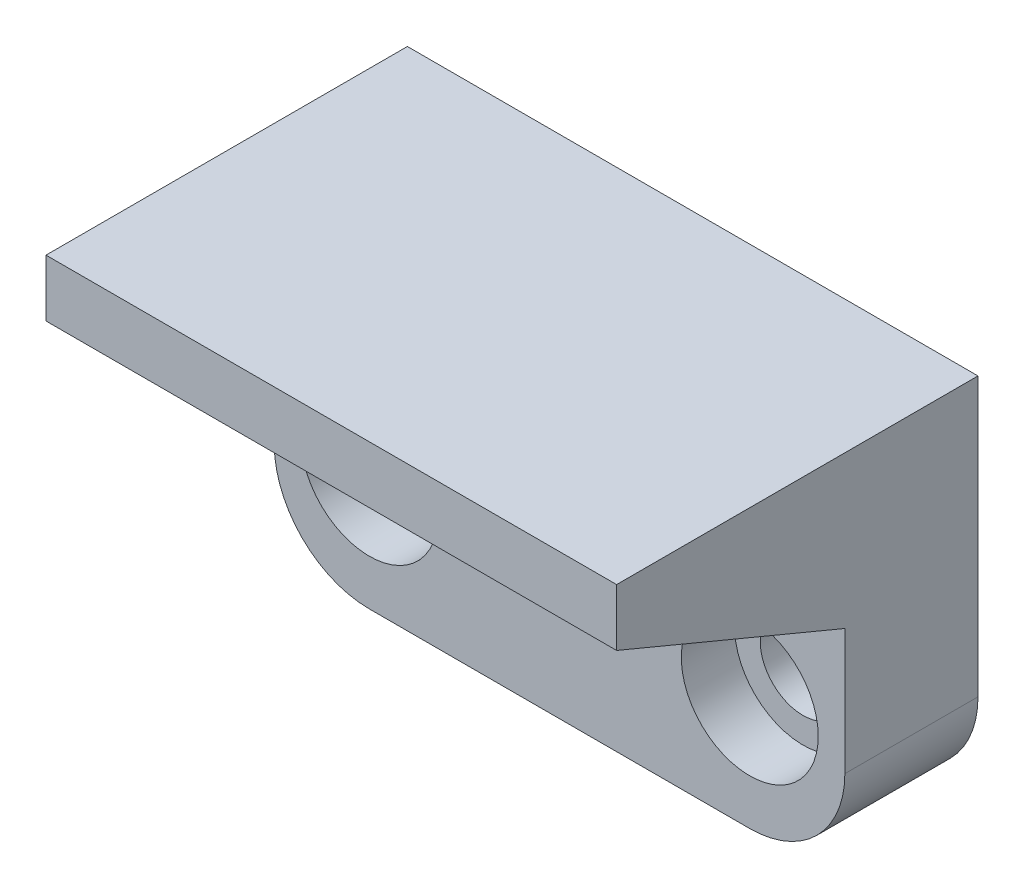
ISO-10303-21;
HEADER;
FILE_DESCRIPTION(('STEP AP214'),'2;1');
FILE_NAME('part.step','',(''),(''),'','','');
FILE_SCHEMA(('AUTOMOTIVE_DESIGN { 1 0 10303 214 1 1 1 1 }'));
ENDSEC;
DATA;
#1=APPLICATION_CONTEXT('core data for automotive mechanical design processes');
#2=APPLICATION_PROTOCOL_DEFINITION('international standard','automotive_design',2000,#1);
#3=PRODUCT_CONTEXT('',#1,'mechanical');
#4=PRODUCT('Part','Part','',(#3));
#5=PRODUCT_RELATED_PRODUCT_CATEGORY('part','',(#4));
#6=PRODUCT_DEFINITION_FORMATION('','',#4);
#7=PRODUCT_DEFINITION_CONTEXT('part definition',#1,'design');
#8=PRODUCT_DEFINITION('design','',#6,#7);
#9=PRODUCT_DEFINITION_SHAPE('','',#8);
#10=(LENGTH_UNIT() NAMED_UNIT(*) SI_UNIT(.MILLI.,.METRE.));
#11=(NAMED_UNIT(*) PLANE_ANGLE_UNIT() SI_UNIT($,.RADIAN.));
#12=(NAMED_UNIT(*) SI_UNIT($,.STERADIAN.) SOLID_ANGLE_UNIT());
#13=UNCERTAINTY_MEASURE_WITH_UNIT(LENGTH_MEASURE(1.E-05),#10,'distance_accuracy_value','');
#14=(GEOMETRIC_REPRESENTATION_CONTEXT(3) GLOBAL_UNCERTAINTY_ASSIGNED_CONTEXT((#13)) GLOBAL_UNIT_ASSIGNED_CONTEXT((#10,
#11,#12)) REPRESENTATION_CONTEXT('',''));
#15=CARTESIAN_POINT('',(0.,0.,0.));
#16=DIRECTION('',(0.,0.,1.));
#17=DIRECTION('',(1.,0.,0.));
#18=AXIS2_PLACEMENT_3D('',#15,#16,#17);
#19=CARTESIAN_POINT('',(0.,0.,7.));
#20=DIRECTION('',(0.,0.,1.));
#21=DIRECTION('',(1.,0.,0.));
#22=AXIS2_PLACEMENT_3D('',#19,#20,#21);
#23=PLANE('',#22);
#24=CARTESIAN_POINT('',(-10.,-3.805,7.));
#25=DIRECTION('',(0.,0.,1.));
#26=DIRECTION('',(1.,0.,0.));
#27=AXIS2_PLACEMENT_3D('',#24,#25,#26);
#28=CIRCLE('',#27,3.6);
#29=CARTESIAN_POINT('',(-6.40000000000001,-3.805,7.));
#30=VERTEX_POINT('',#29);
#31=EDGE_CURVE('E154',#30,#30,#28,.T.);
#32=ORIENTED_EDGE('',*,*,#31,.F.);
#33=EDGE_LOOP('',(#32));
#34=FACE_BOUND('',#33,.T.);
#35=CARTESIAN_POINT('',(9.99999999999999,-3.805,7.));
#36=DIRECTION('',(0.,0.,1.));
#37=DIRECTION('',(1.,0.,0.));
#38=AXIS2_PLACEMENT_3D('',#35,#36,#37);
#39=CIRCLE('',#38,3.6);
#40=CARTESIAN_POINT('',(13.6,-3.805,7.));
#41=VERTEX_POINT('',#40);
#42=EDGE_CURVE('E146',#41,#41,#39,.T.);
#43=ORIENTED_EDGE('',*,*,#42,.F.);
#44=EDGE_LOOP('',(#43));
#45=FACE_BOUND('',#44,.T.);
#46=DIRECTION('',(0.,1.,0.));
#47=VECTOR('',#46,1.);
#48=CARTESIAN_POINT('',(15.,9.805,7.));
#49=LINE('',#48,#47);
#50=CARTESIAN_POINT('',(15.,-4.805,7.));
#51=VERTEX_POINT('',#50);
#52=CARTESIAN_POINT('',(15.,1.80500000000001,7.));
#53=VERTEX_POINT('',#52);
#54=EDGE_CURVE('E174',#51,#53,#49,.T.);
#55=ORIENTED_EDGE('',*,*,#54,.T.);
#56=DIRECTION('',(-1.,0.,0.));
#57=VECTOR('',#56,1.);
#58=CARTESIAN_POINT('',(15.,1.80500000000001,7.));
#59=LINE('',#58,#57);
#60=CARTESIAN_POINT('',(-15.,1.80500000000001,7.));
#61=VERTEX_POINT('',#60);
#62=EDGE_CURVE('E129',#53,#61,#59,.T.);
#63=ORIENTED_EDGE('',*,*,#62,.T.);
#64=DIRECTION('',(0.,-1.,0.));
#65=VECTOR('',#64,1.);
#66=CARTESIAN_POINT('',(-15.,9.805,7.));
#67=LINE('',#66,#65);
#68=CARTESIAN_POINT('',(-15.,-4.805,7.));
#69=VERTEX_POINT('',#68);
#70=EDGE_CURVE('E62',#61,#69,#67,.T.);
#71=ORIENTED_EDGE('',*,*,#70,.T.);
#72=CARTESIAN_POINT('',(-10.,-4.805,7.));
#73=DIRECTION('',(0.,0.,1.));
#74=DIRECTION('',(1.,0.,0.));
#75=AXIS2_PLACEMENT_3D('',#72,#73,#74);
#76=CIRCLE('',#75,5.);
#77=CARTESIAN_POINT('',(-10.,-9.805,7.));
#78=VERTEX_POINT('',#77);
#79=EDGE_CURVE('E220',#69,#78,#76,.T.);
#80=ORIENTED_EDGE('',*,*,#79,.T.);
#81=DIRECTION('',(1.,0.,0.));
#82=VECTOR('',#81,1.);
#83=CARTESIAN_POINT('',(-15.,-9.805,7.));
#84=LINE('',#83,#82);
#85=CARTESIAN_POINT('',(9.99999999999999,-9.805,7.));
#86=VERTEX_POINT('',#85);
#87=EDGE_CURVE('E181',#78,#86,#84,.T.);
#88=ORIENTED_EDGE('',*,*,#87,.T.);
#89=CARTESIAN_POINT('',(9.99999999999999,-4.805,7.));
#90=DIRECTION('',(0.,0.,1.));
#91=DIRECTION('',(1.,0.,0.));
#92=AXIS2_PLACEMENT_3D('',#89,#90,#91);
#93=CIRCLE('',#92,5.);
#94=EDGE_CURVE('E48',#86,#51,#93,.T.);
#95=ORIENTED_EDGE('',*,*,#94,.T.);
#96=EDGE_LOOP('',(#55,#63,#71,#80,#88,#95));
#97=FACE_BOUND('',#96,.T.);
#98=ADVANCED_FACE('F39',(#34,#45,#97),#23,.T.);
#99=CARTESIAN_POINT('',(-10.,-3.805,7.));
#100=DIRECTION('',(0.,0.,-1.));
#101=DIRECTION('',(-1.,0.,0.));
#102=AXIS2_PLACEMENT_3D('',#99,#100,#101);
#103=CYLINDRICAL_SURFACE('',#102,2.25);
#104=CARTESIAN_POINT('',(-10.,-3.805,0.));
#105=DIRECTION('',(0.,0.,1.));
#106=DIRECTION('',(1.,0.,0.));
#107=AXIS2_PLACEMENT_3D('',#104,#105,#106);
#108=CIRCLE('',#107,2.25);
#109=CARTESIAN_POINT('',(-7.75000000000001,-3.805,0.));
#110=VERTEX_POINT('',#109);
#111=EDGE_CURVE('E169',#110,#110,#108,.T.);
#112=ORIENTED_EDGE('',*,*,#111,.F.);
#113=EDGE_LOOP('',(#112));
#114=FACE_BOUND('',#113,.T.);
#115=CARTESIAN_POINT('',(-10.,-3.805,4.2));
#116=DIRECTION('',(0.,0.,1.));
#117=DIRECTION('',(1.,0.,0.));
#118=AXIS2_PLACEMENT_3D('',#115,#116,#117);
#119=CIRCLE('',#118,2.25);
#120=CARTESIAN_POINT('',(-7.75000000000001,-3.805,4.2));
#121=VERTEX_POINT('',#120);
#122=EDGE_CURVE('E170',#121,#121,#119,.T.);
#123=ORIENTED_EDGE('',*,*,#122,.T.);
#124=EDGE_LOOP('',(#123));
#125=FACE_BOUND('',#124,.T.);
#126=ADVANCED_FACE('F253',(#114,#125),#103,.F.);
#127=CARTESIAN_POINT('',(9.99999999999999,-3.805,7.));
#128=DIRECTION('',(0.,0.,-1.));
#129=DIRECTION('',(-1.,0.,0.));
#130=AXIS2_PLACEMENT_3D('',#127,#128,#129);
#131=CYLINDRICAL_SURFACE('',#130,2.25);
#132=CARTESIAN_POINT('',(9.99999999999999,-3.805,0.));
#133=DIRECTION('',(0.,0.,1.));
#134=DIRECTION('',(1.,0.,0.));
#135=AXIS2_PLACEMENT_3D('',#132,#133,#134);
#136=CIRCLE('',#135,2.25);
#137=CARTESIAN_POINT('',(12.25,-3.805,0.));
#138=VERTEX_POINT('',#137);
#139=EDGE_CURVE('E165',#138,#138,#136,.T.);
#140=ORIENTED_EDGE('',*,*,#139,.F.);
#141=EDGE_LOOP('',(#140));
#142=FACE_BOUND('',#141,.T.);
#143=CARTESIAN_POINT('',(9.99999999999999,-3.805,4.2));
#144=DIRECTION('',(0.,0.,1.));
#145=DIRECTION('',(1.,0.,0.));
#146=AXIS2_PLACEMENT_3D('',#143,#144,#145);
#147=CIRCLE('',#146,2.25);
#148=CARTESIAN_POINT('',(12.25,-3.805,4.2));
#149=VERTEX_POINT('',#148);
#150=EDGE_CURVE('E153',#149,#149,#147,.T.);
#151=ORIENTED_EDGE('',*,*,#150,.T.);
#152=EDGE_LOOP('',(#151));
#153=FACE_BOUND('',#152,.T.);
#154=ADVANCED_FACE('F261',(#142,#153),#131,.F.);
#155=CARTESIAN_POINT('',(0.,0.,0.));
#156=DIRECTION('',(0.,0.,1.));
#157=DIRECTION('',(1.,0.,0.));
#158=AXIS2_PLACEMENT_3D('',#155,#156,#157);
#159=PLANE('',#158);
#160=DIRECTION('',(0.,1.,0.));
#161=VECTOR('',#160,1.);
#162=CARTESIAN_POINT('',(15.,9.805,0.));
#163=LINE('',#162,#161);
#164=CARTESIAN_POINT('',(15.,-4.805,0.));
#165=VERTEX_POINT('',#164);
#166=CARTESIAN_POINT('',(15.,9.805,0.));
#167=VERTEX_POINT('',#166);
#168=EDGE_CURVE('E114',#165,#167,#163,.T.);
#169=ORIENTED_EDGE('',*,*,#168,.F.);
#170=CARTESIAN_POINT('',(9.99999999999999,-4.805,0.));
#171=DIRECTION('',(0.,0.,1.));
#172=DIRECTION('',(1.,0.,0.));
#173=AXIS2_PLACEMENT_3D('',#170,#171,#172);
#174=CIRCLE('',#173,5.);
#175=CARTESIAN_POINT('',(9.99999999999999,-9.805,0.));
#176=VERTEX_POINT('',#175);
#177=EDGE_CURVE('E210',#165,#176,#174,.F.);
#178=ORIENTED_EDGE('',*,*,#177,.T.);
#179=DIRECTION('',(1.,0.,0.));
#180=VECTOR('',#179,1.);
#181=CARTESIAN_POINT('',(-15.,-9.805,0.));
#182=LINE('',#181,#180);
#183=CARTESIAN_POINT('',(-10.,-9.805,0.));
#184=VERTEX_POINT('',#183);
#185=EDGE_CURVE('E178',#184,#176,#182,.T.);
#186=ORIENTED_EDGE('',*,*,#185,.F.);
#187=CARTESIAN_POINT('',(-10.,-4.805,0.));
#188=DIRECTION('',(0.,0.,1.));
#189=DIRECTION('',(1.,0.,0.));
#190=AXIS2_PLACEMENT_3D('',#187,#188,#189);
#191=CIRCLE('',#190,5.);
#192=CARTESIAN_POINT('',(-15.,-4.805,0.));
#193=VERTEX_POINT('',#192);
#194=EDGE_CURVE('E207',#184,#193,#191,.F.);
#195=ORIENTED_EDGE('',*,*,#194,.T.);
#196=DIRECTION('',(0.,-1.,0.));
#197=VECTOR('',#196,1.);
#198=CARTESIAN_POINT('',(-15.,9.805,0.));
#199=LINE('',#198,#197);
#200=CARTESIAN_POINT('',(-15.,9.805,0.));
#201=VERTEX_POINT('',#200);
#202=EDGE_CURVE('E190',#201,#193,#199,.T.);
#203=ORIENTED_EDGE('',*,*,#202,.F.);
#204=DIRECTION('',(-1.,0.,0.));
#205=VECTOR('',#204,1.);
#206=CARTESIAN_POINT('',(-15.,9.805,0.));
#207=LINE('',#206,#205);
#208=EDGE_CURVE('E187',#167,#201,#207,.T.);
#209=ORIENTED_EDGE('',*,*,#208,.F.);
#210=EDGE_LOOP('',(#169,#178,#186,#195,#203,#209));
#211=FACE_BOUND('',#210,.T.);
#212=ORIENTED_EDGE('',*,*,#111,.T.);
#213=EDGE_LOOP('',(#212));
#214=FACE_BOUND('',#213,.T.);
#215=ORIENTED_EDGE('',*,*,#139,.T.);
#216=EDGE_LOOP('',(#215));
#217=FACE_BOUND('',#216,.T.);
#218=ADVANCED_FACE('F231',(#211,#214,#217),#159,.F.);
#219=CARTESIAN_POINT('',(15.,9.805,7.));
#220=DIRECTION('',(-1.,0.,0.));
#221=DIRECTION('',(0.,-1.,0.));
#222=AXIS2_PLACEMENT_3D('',#219,#220,#221);
#223=PLANE('',#222);
#224=ORIENTED_EDGE('',*,*,#54,.F.);
#225=DIRECTION('',(0.,0.,-1.));
#226=VECTOR('',#225,1.);
#227=CARTESIAN_POINT('',(15.,-4.805,7.));
#228=LINE('',#227,#226);
#229=EDGE_CURVE('E118',#51,#165,#228,.T.);
#230=ORIENTED_EDGE('',*,*,#229,.T.);
#231=ORIENTED_EDGE('',*,*,#168,.T.);
#232=DIRECTION('',(0.,0.,-1.));
#233=VECTOR('',#232,1.);
#234=CARTESIAN_POINT('',(15.,9.805,7.));
#235=LINE('',#234,#233);
#236=CARTESIAN_POINT('',(15.,9.80500000000001,19.));
#237=VERTEX_POINT('',#236);
#238=EDGE_CURVE('E104',#237,#167,#235,.T.);
#239=ORIENTED_EDGE('',*,*,#238,.F.);
#240=DIRECTION('',(0.,1.,0.));
#241=VECTOR('',#240,1.);
#242=CARTESIAN_POINT('',(15.,9.80500000000001,19.));
#243=LINE('',#242,#241);
#244=CARTESIAN_POINT('',(15.,6.80500000000001,19.));
#245=VERTEX_POINT('',#244);
#246=EDGE_CURVE('E110',#245,#237,#243,.T.);
#247=ORIENTED_EDGE('',*,*,#246,.F.);
#248=DIRECTION('',(0.,0.384615384615385,0.923076923076923));
#249=VECTOR('',#248,1.);
#250=CARTESIAN_POINT('',(15.,6.80500000000001,19.));
#251=LINE('',#250,#249);
#252=EDGE_CURVE('E130',#53,#245,#251,.T.);
#253=ORIENTED_EDGE('',*,*,#252,.F.);
#254=EDGE_LOOP('',(#224,#230,#231,#239,#247,#253));
#255=FACE_BOUND('',#254,.T.);
#256=ADVANCED_FACE('F107',(#255),#223,.F.);
#257=CARTESIAN_POINT('',(-15.,9.805,7.));
#258=DIRECTION('',(0.,-1.,0.));
#259=DIRECTION('',(0.,0.,-1.));
#260=AXIS2_PLACEMENT_3D('',#257,#258,#259);
#261=PLANE('',#260);
#262=ORIENTED_EDGE('',*,*,#208,.T.);
#263=DIRECTION('',(0.,0.,-1.));
#264=VECTOR('',#263,1.);
#265=CARTESIAN_POINT('',(-15.,9.805,7.));
#266=LINE('',#265,#264);
#267=CARTESIAN_POINT('',(-15.,9.805,19.));
#268=VERTEX_POINT('',#267);
#269=EDGE_CURVE('E119',#268,#201,#266,.T.);
#270=ORIENTED_EDGE('',*,*,#269,.F.);
#271=DIRECTION('',(-1.,0.,0.));
#272=VECTOR('',#271,1.);
#273=CARTESIAN_POINT('',(15.,9.80500000000001,19.));
#274=LINE('',#273,#272);
#275=EDGE_CURVE('E122',#237,#268,#274,.T.);
#276=ORIENTED_EDGE('',*,*,#275,.F.);
#277=ORIENTED_EDGE('',*,*,#238,.T.);
#278=EDGE_LOOP('',(#262,#270,#276,#277));
#279=FACE_BOUND('',#278,.T.);
#280=ADVANCED_FACE('F123',(#279),#261,.F.);
#281=CARTESIAN_POINT('',(-15.,9.805,7.));
#282=DIRECTION('',(1.,0.,0.));
#283=DIRECTION('',(0.,1.,0.));
#284=AXIS2_PLACEMENT_3D('',#281,#282,#283);
#285=PLANE('',#284);
#286=ORIENTED_EDGE('',*,*,#202,.T.);
#287=DIRECTION('',(0.,0.,-1.));
#288=VECTOR('',#287,1.);
#289=CARTESIAN_POINT('',(-15.,-4.805,7.));
#290=LINE('',#289,#288);
#291=EDGE_CURVE('E11',#193,#69,#290,.F.);
#292=ORIENTED_EDGE('',*,*,#291,.T.);
#293=ORIENTED_EDGE('',*,*,#70,.F.);
#294=DIRECTION('',(0.,0.384615384615385,0.923076923076923));
#295=VECTOR('',#294,1.);
#296=CARTESIAN_POINT('',(-15.,6.805,19.));
#297=LINE('',#296,#295);
#298=CARTESIAN_POINT('',(-15.,6.805,19.));
#299=VERTEX_POINT('',#298);
#300=EDGE_CURVE('E55',#61,#299,#297,.T.);
#301=ORIENTED_EDGE('',*,*,#300,.T.);
#302=DIRECTION('',(0.,1.,0.));
#303=VECTOR('',#302,1.);
#304=CARTESIAN_POINT('',(-15.,9.805,19.));
#305=LINE('',#304,#303);
#306=EDGE_CURVE('E139',#299,#268,#305,.T.);
#307=ORIENTED_EDGE('',*,*,#306,.T.);
#308=ORIENTED_EDGE('',*,*,#269,.T.);
#309=EDGE_LOOP('',(#286,#292,#293,#301,#307,#308));
#310=FACE_BOUND('',#309,.T.);
#311=ADVANCED_FACE('F241',(#310),#285,.F.);
#312=CARTESIAN_POINT('',(-15.,-9.805,7.));
#313=DIRECTION('',(0.,1.,0.));
#314=DIRECTION('',(0.,0.,1.));
#315=AXIS2_PLACEMENT_3D('',#312,#313,#314);
#316=PLANE('',#315);
#317=ORIENTED_EDGE('',*,*,#185,.T.);
#318=DIRECTION('',(0.,0.,-1.));
#319=VECTOR('',#318,1.);
#320=CARTESIAN_POINT('',(9.99999999999999,-9.805,7.));
#321=LINE('',#320,#319);
#322=EDGE_CURVE('E217',#176,#86,#321,.F.);
#323=ORIENTED_EDGE('',*,*,#322,.T.);
#324=ORIENTED_EDGE('',*,*,#87,.F.);
#325=DIRECTION('',(0.,0.,-1.));
#326=VECTOR('',#325,1.);
#327=CARTESIAN_POINT('',(-10.,-9.805,7.));
#328=LINE('',#327,#326);
#329=EDGE_CURVE('E213',#78,#184,#328,.T.);
#330=ORIENTED_EDGE('',*,*,#329,.T.);
#331=EDGE_LOOP('',(#317,#323,#324,#330));
#332=FACE_BOUND('',#331,.T.);
#333=ADVANCED_FACE('F234',(#332),#316,.F.);
#334=CARTESIAN_POINT('',(9.99999999999999,-3.805,4.2));
#335=DIRECTION('',(0.,0.,1.));
#336=DIRECTION('',(1.,0.,0.));
#337=AXIS2_PLACEMENT_3D('',#334,#335,#336);
#338=CYLINDRICAL_SURFACE('',#337,3.6);
#339=CARTESIAN_POINT('',(9.99999999999999,-3.805,4.2));
#340=DIRECTION('',(0.,0.,1.));
#341=DIRECTION('',(1.,0.,0.));
#342=AXIS2_PLACEMENT_3D('',#339,#340,#341);
#343=CIRCLE('',#342,3.6);
#344=CARTESIAN_POINT('',(13.6,-3.805,4.2));
#345=VERTEX_POINT('',#344);
#346=EDGE_CURVE('E158',#345,#345,#343,.T.);
#347=ORIENTED_EDGE('',*,*,#346,.F.);
#348=EDGE_LOOP('',(#347));
#349=FACE_BOUND('',#348,.T.);
#350=ORIENTED_EDGE('',*,*,#42,.T.);
#351=EDGE_LOOP('',(#350));
#352=FACE_BOUND('',#351,.T.);
#353=ADVANCED_FACE('F249',(#349,#352),#338,.F.);
#354=CARTESIAN_POINT('',(9.99999999999999,-3.805,4.2));
#355=DIRECTION('',(0.,0.,1.));
#356=DIRECTION('',(1.,0.,0.));
#357=AXIS2_PLACEMENT_3D('',#354,#355,#356);
#358=PLANE('',#357);
#359=ORIENTED_EDGE('',*,*,#150,.F.);
#360=EDGE_LOOP('',(#359));
#361=FACE_BOUND('',#360,.T.);
#362=ORIENTED_EDGE('',*,*,#346,.T.);
#363=EDGE_LOOP('',(#362));
#364=FACE_BOUND('',#363,.T.);
#365=ADVANCED_FACE('F282',(#361,#364),#358,.T.);
#366=CARTESIAN_POINT('',(-10.,-3.805,4.2));
#367=DIRECTION('',(0.,0.,1.));
#368=DIRECTION('',(1.,0.,0.));
#369=AXIS2_PLACEMENT_3D('',#366,#367,#368);
#370=CYLINDRICAL_SURFACE('',#369,3.6);
#371=CARTESIAN_POINT('',(-10.,-3.805,4.2));
#372=DIRECTION('',(0.,0.,1.));
#373=DIRECTION('',(1.,0.,0.));
#374=AXIS2_PLACEMENT_3D('',#371,#372,#373);
#375=CIRCLE('',#374,3.6);
#376=CARTESIAN_POINT('',(-6.40000000000001,-3.805,4.2));
#377=VERTEX_POINT('',#376);
#378=EDGE_CURVE('E149',#377,#377,#375,.T.);
#379=ORIENTED_EDGE('',*,*,#378,.F.);
#380=EDGE_LOOP('',(#379));
#381=FACE_BOUND('',#380,.T.);
#382=ORIENTED_EDGE('',*,*,#31,.T.);
#383=EDGE_LOOP('',(#382));
#384=FACE_BOUND('',#383,.T.);
#385=ADVANCED_FACE('F286',(#381,#384),#370,.F.);
#386=CARTESIAN_POINT('',(-10.,-3.805,4.2));
#387=DIRECTION('',(0.,0.,1.));
#388=DIRECTION('',(1.,0.,0.));
#389=AXIS2_PLACEMENT_3D('',#386,#387,#388);
#390=PLANE('',#389);
#391=ORIENTED_EDGE('',*,*,#122,.F.);
#392=EDGE_LOOP('',(#391));
#393=FACE_BOUND('',#392,.T.);
#394=ORIENTED_EDGE('',*,*,#378,.T.);
#395=EDGE_LOOP('',(#394));
#396=FACE_BOUND('',#395,.T.);
#397=ADVANCED_FACE('F290',(#393,#396),#390,.T.);
#398=CARTESIAN_POINT('',(9.99999999999999,-4.805,7.));
#399=DIRECTION('',(0.,0.,-1.));
#400=DIRECTION('',(-1.,0.,0.));
#401=AXIS2_PLACEMENT_3D('',#398,#399,#400);
#402=CYLINDRICAL_SURFACE('',#401,5.);
#403=ORIENTED_EDGE('',*,*,#94,.F.);
#404=ORIENTED_EDGE('',*,*,#322,.F.);
#405=ORIENTED_EDGE('',*,*,#177,.F.);
#406=ORIENTED_EDGE('',*,*,#229,.F.);
#407=EDGE_LOOP('',(#403,#404,#405,#406));
#408=FACE_BOUND('',#407,.T.);
#409=ADVANCED_FACE('F228',(#408),#402,.T.);
#410=CARTESIAN_POINT('',(-10.,-4.805,7.));
#411=DIRECTION('',(0.,0.,-1.));
#412=DIRECTION('',(-1.,0.,0.));
#413=AXIS2_PLACEMENT_3D('',#410,#411,#412);
#414=CYLINDRICAL_SURFACE('',#413,5.);
#415=ORIENTED_EDGE('',*,*,#79,.F.);
#416=ORIENTED_EDGE('',*,*,#291,.F.);
#417=ORIENTED_EDGE('',*,*,#194,.F.);
#418=ORIENTED_EDGE('',*,*,#329,.F.);
#419=EDGE_LOOP('',(#415,#416,#417,#418));
#420=FACE_BOUND('',#419,.T.);
#421=ADVANCED_FACE('F41',(#420),#414,.T.);
#422=CARTESIAN_POINT('',(15.,9.80500000000001,19.));
#423=DIRECTION('',(0.,0.,1.));
#424=DIRECTION('',(1.,0.,0.));
#425=AXIS2_PLACEMENT_3D('',#422,#423,#424);
#426=PLANE('',#425);
#427=ORIENTED_EDGE('',*,*,#306,.F.);
#428=DIRECTION('',(-1.,0.,0.));
#429=VECTOR('',#428,1.);
#430=CARTESIAN_POINT('',(15.,6.80500000000001,19.));
#431=LINE('',#430,#429);
#432=EDGE_CURVE('E133',#245,#299,#431,.T.);
#433=ORIENTED_EDGE('',*,*,#432,.F.);
#434=ORIENTED_EDGE('',*,*,#246,.T.);
#435=ORIENTED_EDGE('',*,*,#275,.T.);
#436=EDGE_LOOP('',(#427,#433,#434,#435));
#437=FACE_BOUND('',#436,.T.);
#438=ADVANCED_FACE('F132',(#437),#426,.T.);
#439=CARTESIAN_POINT('',(15.,6.80500000000001,19.));
#440=DIRECTION('',(0.,-0.923076923076923,0.384615384615385));
#441=DIRECTION('',(0.,-0.384615384615385,-0.923076923076923));
#442=AXIS2_PLACEMENT_3D('',#439,#440,#441);
#443=PLANE('',#442);
#444=ORIENTED_EDGE('',*,*,#300,.F.);
#445=ORIENTED_EDGE('',*,*,#62,.F.);
#446=ORIENTED_EDGE('',*,*,#252,.T.);
#447=ORIENTED_EDGE('',*,*,#432,.T.);
#448=EDGE_LOOP('',(#444,#445,#446,#447));
#449=FACE_BOUND('',#448,.T.);
#450=ADVANCED_FACE('F296',(#449),#443,.T.);
#451=CLOSED_SHELL('',(#98,#126,#154,#218,#256,#280,#311,#333,#353,#365,#385,#397,#409,#421,#438,#450));
#452=MANIFOLD_SOLID_BREP('B2',#451);
#453=ADVANCED_BREP_SHAPE_REPRESENTATION('',(#18,#452),#14);
#454=SHAPE_DEFINITION_REPRESENTATION(#9,#453);
ENDSEC;
END-ISO-10303-21;
